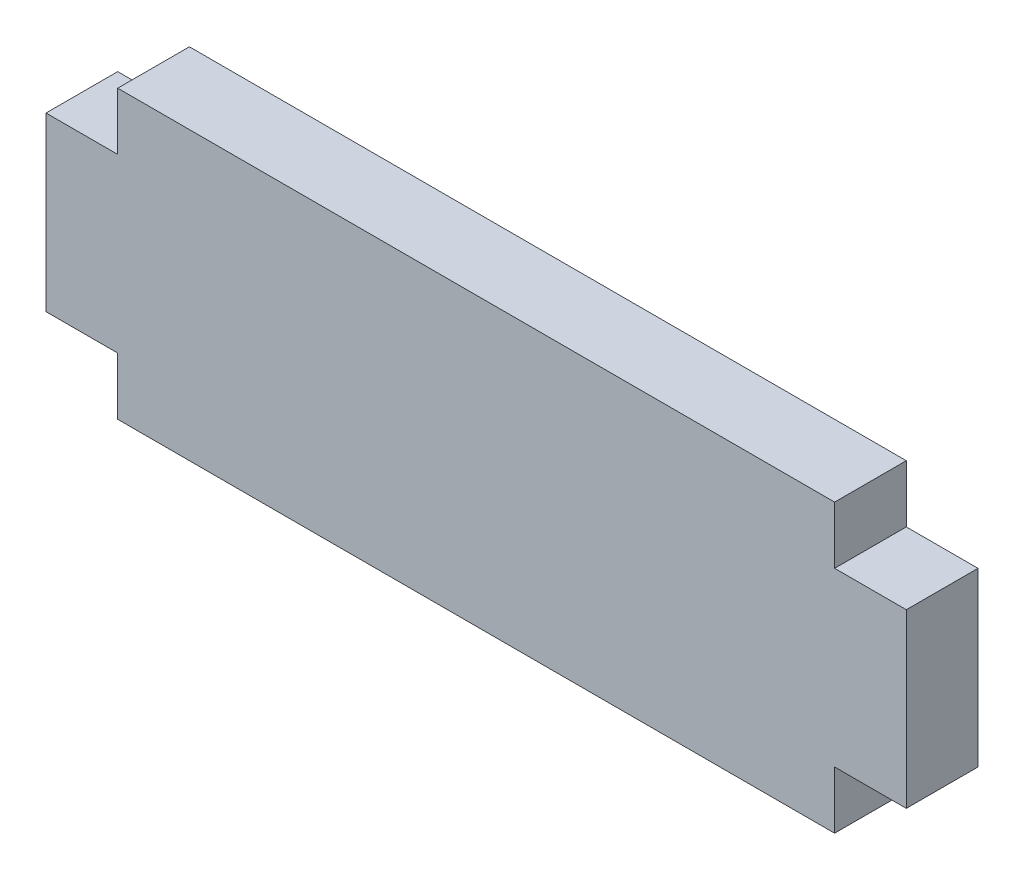
ISO-10303-21;
HEADER;
FILE_DESCRIPTION(('STEP AP214'),'2;1');
FILE_NAME('part.step','',(''),(''),'','','');
FILE_SCHEMA(('AUTOMOTIVE_DESIGN { 1 0 10303 214 1 1 1 1 }'));
ENDSEC;
DATA;
#1=APPLICATION_CONTEXT('core data for automotive mechanical design processes');
#2=APPLICATION_PROTOCOL_DEFINITION('international standard','automotive_design',2000,#1);
#3=PRODUCT_CONTEXT('',#1,'mechanical');
#4=PRODUCT('Part','Part','',(#3));
#5=PRODUCT_RELATED_PRODUCT_CATEGORY('part','',(#4));
#6=PRODUCT_DEFINITION_FORMATION('','',#4);
#7=PRODUCT_DEFINITION_CONTEXT('part definition',#1,'design');
#8=PRODUCT_DEFINITION('design','',#6,#7);
#9=PRODUCT_DEFINITION_SHAPE('','',#8);
#10=(LENGTH_UNIT() NAMED_UNIT(*) SI_UNIT(.MILLI.,.METRE.));
#11=(NAMED_UNIT(*) PLANE_ANGLE_UNIT() SI_UNIT($,.RADIAN.));
#12=(NAMED_UNIT(*) SI_UNIT($,.STERADIAN.) SOLID_ANGLE_UNIT());
#13=UNCERTAINTY_MEASURE_WITH_UNIT(LENGTH_MEASURE(1.E-05),#10,'distance_accuracy_value','');
#14=(GEOMETRIC_REPRESENTATION_CONTEXT(3) GLOBAL_UNCERTAINTY_ASSIGNED_CONTEXT((#13)) GLOBAL_UNIT_ASSIGNED_CONTEXT((#10,
#11,#12)) REPRESENTATION_CONTEXT('',''));
#15=CARTESIAN_POINT('',(0.,0.,0.));
#16=DIRECTION('',(0.,0.,1.));
#17=DIRECTION('',(1.,0.,0.));
#18=AXIS2_PLACEMENT_3D('',#15,#16,#17);
#19=CARTESIAN_POINT('',(31.75,0.,3.175));
#20=DIRECTION('',(-1.,0.,0.));
#21=DIRECTION('',(0.,0.,1.));
#22=AXIS2_PLACEMENT_3D('',#19,#20,#21);
#23=PLANE('',#22);
#24=DIRECTION('',(0.,0.,1.));
#25=VECTOR('',#24,1.);
#26=CARTESIAN_POINT('',(31.75,10.16,0.));
#27=LINE('',#26,#25);
#28=CARTESIAN_POINT('',(31.75,10.16,0.));
#29=VERTEX_POINT('',#28);
#30=CARTESIAN_POINT('',(31.75,10.16,3.175));
#31=VERTEX_POINT('',#30);
#32=EDGE_CURVE('E239',#29,#31,#27,.T.);
#33=ORIENTED_EDGE('',*,*,#32,.F.);
#34=DIRECTION('',(0.,1.,0.));
#35=VECTOR('',#34,1.);
#36=CARTESIAN_POINT('',(31.75,0.,0.));
#37=LINE('',#36,#35);
#38=CARTESIAN_POINT('',(31.75,12.7,0.));
#39=VERTEX_POINT('',#38);
#40=EDGE_CURVE('E157',#29,#39,#37,.T.);
#41=ORIENTED_EDGE('',*,*,#40,.T.);
#42=DIRECTION('',(0.,0.,-1.));
#43=VECTOR('',#42,1.);
#44=CARTESIAN_POINT('',(31.75,12.7,3.175));
#45=LINE('',#44,#43);
#46=CARTESIAN_POINT('',(31.75,12.7,3.175));
#47=VERTEX_POINT('',#46);
#48=EDGE_CURVE('E171',#47,#39,#45,.T.);
#49=ORIENTED_EDGE('',*,*,#48,.F.);
#50=DIRECTION('',(0.,1.,0.));
#51=VECTOR('',#50,1.);
#52=CARTESIAN_POINT('',(31.75,0.,3.175));
#53=LINE('',#52,#51);
#54=EDGE_CURVE('E181',#31,#47,#53,.T.);
#55=ORIENTED_EDGE('',*,*,#54,.F.);
#56=EDGE_LOOP('',(#33,#41,#49,#55));
#57=FACE_BOUND('',#56,.T.);
#58=ADVANCED_FACE('F39',(#57),#23,.F.);
#59=CARTESIAN_POINT('',(0.,0.,3.175));
#60=DIRECTION('',(1.,0.,0.));
#61=DIRECTION('',(0.,0.,-1.));
#62=AXIS2_PLACEMENT_3D('',#59,#60,#61);
#63=PLANE('',#62);
#64=DIRECTION('',(0.,0.,1.));
#65=VECTOR('',#64,1.);
#66=CARTESIAN_POINT('',(0.,2.54,0.));
#67=LINE('',#66,#65);
#68=CARTESIAN_POINT('',(0.,2.54,0.));
#69=VERTEX_POINT('',#68);
#70=CARTESIAN_POINT('',(0.,2.54,3.175));
#71=VERTEX_POINT('',#70);
#72=EDGE_CURVE('E205',#69,#71,#67,.T.);
#73=ORIENTED_EDGE('',*,*,#72,.F.);
#74=DIRECTION('',(0.,-1.,0.));
#75=VECTOR('',#74,1.);
#76=CARTESIAN_POINT('',(0.,0.,0.));
#77=LINE('',#76,#75);
#78=CARTESIAN_POINT('',(0.,0.,0.));
#79=VERTEX_POINT('',#78);
#80=EDGE_CURVE('E201',#69,#79,#77,.T.);
#81=ORIENTED_EDGE('',*,*,#80,.T.);
#82=DIRECTION('',(0.,0.,-1.));
#83=VECTOR('',#82,1.);
#84=CARTESIAN_POINT('',(0.,0.,3.175));
#85=LINE('',#84,#83);
#86=CARTESIAN_POINT('',(0.,0.,3.175));
#87=VERTEX_POINT('',#86);
#88=EDGE_CURVE('E11',#87,#79,#85,.T.);
#89=ORIENTED_EDGE('',*,*,#88,.F.);
#90=DIRECTION('',(0.,-1.,0.));
#91=VECTOR('',#90,1.);
#92=CARTESIAN_POINT('',(0.,0.,3.175));
#93=LINE('',#92,#91);
#94=EDGE_CURVE('E161',#71,#87,#93,.T.);
#95=ORIENTED_EDGE('',*,*,#94,.F.);
#96=EDGE_LOOP('',(#73,#81,#89,#95));
#97=FACE_BOUND('',#96,.T.);
#98=ADVANCED_FACE('F297',(#97),#63,.F.);
#99=CARTESIAN_POINT('',(0.,12.7,0.));
#100=VERTEX_POINT('',#99);
#101=CARTESIAN_POINT('',(0.,10.16,0.));
#102=VERTEX_POINT('',#101);
#103=EDGE_CURVE('E198',#100,#102,#77,.T.);
#104=ORIENTED_EDGE('',*,*,#103,.T.);
#105=DIRECTION('',(0.,0.,1.));
#106=VECTOR('',#105,1.);
#107=CARTESIAN_POINT('',(0.,10.16,0.));
#108=LINE('',#107,#106);
#109=CARTESIAN_POINT('',(0.,10.16,3.175));
#110=VERTEX_POINT('',#109);
#111=EDGE_CURVE('E196',#102,#110,#108,.T.);
#112=ORIENTED_EDGE('',*,*,#111,.T.);
#113=CARTESIAN_POINT('',(0.,12.7,3.175));
#114=VERTEX_POINT('',#113);
#115=EDGE_CURVE('E186',#114,#110,#93,.T.);
#116=ORIENTED_EDGE('',*,*,#115,.F.);
#117=DIRECTION('',(0.,0.,-1.));
#118=VECTOR('',#117,1.);
#119=CARTESIAN_POINT('',(0.,12.7,3.175));
#120=LINE('',#119,#118);
#121=EDGE_CURVE('E167',#114,#100,#120,.T.);
#122=ORIENTED_EDGE('',*,*,#121,.T.);
#123=EDGE_LOOP('',(#104,#112,#116,#122));
#124=FACE_BOUND('',#123,.T.);
#125=ADVANCED_FACE('F41',(#124),#63,.F.);
#126=CARTESIAN_POINT('',(0.,0.,3.175));
#127=DIRECTION('',(0.,1.,0.));
#128=DIRECTION('',(0.,0.,1.));
#129=AXIS2_PLACEMENT_3D('',#126,#127,#128);
#130=PLANE('',#129);
#131=DIRECTION('',(1.,0.,0.));
#132=VECTOR('',#131,1.);
#133=CARTESIAN_POINT('',(0.,0.,0.));
#134=LINE('',#133,#132);
#135=CARTESIAN_POINT('',(31.75,0.,0.));
#136=VERTEX_POINT('',#135);
#137=EDGE_CURVE('E163',#79,#136,#134,.T.);
#138=ORIENTED_EDGE('',*,*,#137,.T.);
#139=DIRECTION('',(0.,0.,-1.));
#140=VECTOR('',#139,1.);
#141=CARTESIAN_POINT('',(31.75,0.,3.175));
#142=LINE('',#141,#140);
#143=CARTESIAN_POINT('',(31.75,0.,3.175));
#144=VERTEX_POINT('',#143);
#145=EDGE_CURVE('E48',#144,#136,#142,.T.);
#146=ORIENTED_EDGE('',*,*,#145,.F.);
#147=DIRECTION('',(1.,0.,0.));
#148=VECTOR('',#147,1.);
#149=CARTESIAN_POINT('',(0.,0.,3.175));
#150=LINE('',#149,#148);
#151=EDGE_CURVE('E184',#87,#144,#150,.T.);
#152=ORIENTED_EDGE('',*,*,#151,.F.);
#153=ORIENTED_EDGE('',*,*,#88,.T.);
#154=EDGE_LOOP('',(#138,#146,#152,#153));
#155=FACE_BOUND('',#154,.T.);
#156=ADVANCED_FACE('F281',(#155),#130,.F.);
#157=CARTESIAN_POINT('',(31.75,2.54,0.));
#158=VERTEX_POINT('',#157);
#159=EDGE_CURVE('E145',#136,#158,#37,.T.);
#160=ORIENTED_EDGE('',*,*,#159,.T.);
#161=DIRECTION('',(0.,0.,1.));
#162=VECTOR('',#161,1.);
#163=CARTESIAN_POINT('',(31.75,2.54,0.));
#164=LINE('',#163,#162);
#165=CARTESIAN_POINT('',(31.75,2.54,3.175));
#166=VERTEX_POINT('',#165);
#167=EDGE_CURVE('E127',#158,#166,#164,.T.);
#168=ORIENTED_EDGE('',*,*,#167,.T.);
#169=EDGE_CURVE('E178',#144,#166,#53,.T.);
#170=ORIENTED_EDGE('',*,*,#169,.F.);
#171=ORIENTED_EDGE('',*,*,#145,.T.);
#172=EDGE_LOOP('',(#160,#168,#170,#171));
#173=FACE_BOUND('',#172,.T.);
#174=ADVANCED_FACE('F153',(#173),#23,.F.);
#175=CARTESIAN_POINT('',(0.,12.7,3.175));
#176=DIRECTION('',(0.,-1.,0.));
#177=DIRECTION('',(0.,0.,-1.));
#178=AXIS2_PLACEMENT_3D('',#175,#176,#177);
#179=PLANE('',#178);
#180=DIRECTION('',(-1.,0.,0.));
#181=VECTOR('',#180,1.);
#182=CARTESIAN_POINT('',(0.,12.7,0.));
#183=LINE('',#182,#181);
#184=EDGE_CURVE('E156',#39,#100,#183,.T.);
#185=ORIENTED_EDGE('',*,*,#184,.T.);
#186=ORIENTED_EDGE('',*,*,#121,.F.);
#187=DIRECTION('',(-1.,0.,0.));
#188=VECTOR('',#187,1.);
#189=CARTESIAN_POINT('',(0.,12.7,3.175));
#190=LINE('',#189,#188);
#191=EDGE_CURVE('E172',#47,#114,#190,.T.);
#192=ORIENTED_EDGE('',*,*,#191,.F.);
#193=ORIENTED_EDGE('',*,*,#48,.T.);
#194=EDGE_LOOP('',(#185,#186,#192,#193));
#195=FACE_BOUND('',#194,.T.);
#196=ADVANCED_FACE('F286',(#195),#179,.F.);
#197=CARTESIAN_POINT('',(0.,0.,3.175));
#198=DIRECTION('',(0.,0.,-1.));
#199=DIRECTION('',(-1.,0.,0.));
#200=AXIS2_PLACEMENT_3D('',#197,#198,#199);
#201=PLANE('',#200);
#202=ORIENTED_EDGE('',*,*,#115,.T.);
#203=DIRECTION('',(-1.,0.,0.));
#204=VECTOR('',#203,1.);
#205=CARTESIAN_POINT('',(0.,10.16,3.175));
#206=LINE('',#205,#204);
#207=CARTESIAN_POINT('',(-3.175,10.16,3.175));
#208=VERTEX_POINT('',#207);
#209=EDGE_CURVE('E63',#110,#208,#206,.T.);
#210=ORIENTED_EDGE('',*,*,#209,.T.);
#211=DIRECTION('',(0.,-1.,0.));
#212=VECTOR('',#211,1.);
#213=CARTESIAN_POINT('',(-3.175,10.16,3.175));
#214=LINE('',#213,#212);
#215=CARTESIAN_POINT('',(-3.175,2.54,3.175));
#216=VERTEX_POINT('',#215);
#217=EDGE_CURVE('E238',#208,#216,#214,.T.);
#218=ORIENTED_EDGE('',*,*,#217,.T.);
#219=DIRECTION('',(1.,0.,0.));
#220=VECTOR('',#219,1.);
#221=CARTESIAN_POINT('',(0.,2.54,3.175));
#222=LINE('',#221,#220);
#223=EDGE_CURVE('E219',#216,#71,#222,.T.);
#224=ORIENTED_EDGE('',*,*,#223,.T.);
#225=ORIENTED_EDGE('',*,*,#94,.T.);
#226=ORIENTED_EDGE('',*,*,#151,.T.);
#227=ORIENTED_EDGE('',*,*,#169,.T.);
#228=DIRECTION('',(1.,0.,0.));
#229=VECTOR('',#228,1.);
#230=CARTESIAN_POINT('',(31.75,2.54,3.175));
#231=LINE('',#230,#229);
#232=CARTESIAN_POINT('',(34.925,2.54,3.175));
#233=VERTEX_POINT('',#232);
#234=EDGE_CURVE('E55',#166,#233,#231,.T.);
#235=ORIENTED_EDGE('',*,*,#234,.T.);
#236=DIRECTION('',(0.,1.,0.));
#237=VECTOR('',#236,1.);
#238=CARTESIAN_POINT('',(34.925,10.16,3.175));
#239=LINE('',#238,#237);
#240=CARTESIAN_POINT('',(34.925,10.16,3.175));
#241=VERTEX_POINT('',#240);
#242=EDGE_CURVE('E256',#233,#241,#239,.T.);
#243=ORIENTED_EDGE('',*,*,#242,.T.);
#244=DIRECTION('',(-1.,0.,0.));
#245=VECTOR('',#244,1.);
#246=CARTESIAN_POINT('',(31.75,10.16,3.175));
#247=LINE('',#246,#245);
#248=EDGE_CURVE('E150',#241,#31,#247,.T.);
#249=ORIENTED_EDGE('',*,*,#248,.T.);
#250=ORIENTED_EDGE('',*,*,#54,.T.);
#251=ORIENTED_EDGE('',*,*,#191,.T.);
#252=EDGE_LOOP('',(#202,#210,#218,#224,#225,#226,#227,#235,#243,#249,#250,#251));
#253=FACE_BOUND('',#252,.T.);
#254=ADVANCED_FACE('F278',(#253),#201,.F.);
#255=CARTESIAN_POINT('',(0.,0.,0.));
#256=DIRECTION('',(0.,0.,-1.));
#257=DIRECTION('',(-1.,0.,0.));
#258=AXIS2_PLACEMENT_3D('',#255,#256,#257);
#259=PLANE('',#258);
#260=ORIENTED_EDGE('',*,*,#103,.F.);
#261=ORIENTED_EDGE('',*,*,#184,.F.);
#262=ORIENTED_EDGE('',*,*,#40,.F.);
#263=DIRECTION('',(-1.,0.,0.));
#264=VECTOR('',#263,1.);
#265=CARTESIAN_POINT('',(31.75,10.16,0.));
#266=LINE('',#265,#264);
#267=CARTESIAN_POINT('',(34.925,10.16,0.));
#268=VERTEX_POINT('',#267);
#269=EDGE_CURVE('E137',#268,#29,#266,.T.);
#270=ORIENTED_EDGE('',*,*,#269,.F.);
#271=DIRECTION('',(0.,1.,0.));
#272=VECTOR('',#271,1.);
#273=CARTESIAN_POINT('',(34.925,10.16,0.));
#274=LINE('',#273,#272);
#275=CARTESIAN_POINT('',(34.925,2.54,0.));
#276=VERTEX_POINT('',#275);
#277=EDGE_CURVE('E148',#276,#268,#274,.T.);
#278=ORIENTED_EDGE('',*,*,#277,.F.);
#279=DIRECTION('',(1.,0.,0.));
#280=VECTOR('',#279,1.);
#281=CARTESIAN_POINT('',(31.75,2.54,0.));
#282=LINE('',#281,#280);
#283=EDGE_CURVE('E130',#158,#276,#282,.T.);
#284=ORIENTED_EDGE('',*,*,#283,.F.);
#285=ORIENTED_EDGE('',*,*,#159,.F.);
#286=ORIENTED_EDGE('',*,*,#137,.F.);
#287=ORIENTED_EDGE('',*,*,#80,.F.);
#288=DIRECTION('',(1.,0.,0.));
#289=VECTOR('',#288,1.);
#290=CARTESIAN_POINT('',(0.,2.54,0.));
#291=LINE('',#290,#289);
#292=CARTESIAN_POINT('',(-3.175,2.54,0.));
#293=VERTEX_POINT('',#292);
#294=EDGE_CURVE('E225',#293,#69,#291,.T.);
#295=ORIENTED_EDGE('',*,*,#294,.F.);
#296=DIRECTION('',(0.,-1.,0.));
#297=VECTOR('',#296,1.);
#298=CARTESIAN_POINT('',(-3.175,10.16,0.));
#299=LINE('',#298,#297);
#300=CARTESIAN_POINT('',(-3.175,10.16,0.));
#301=VERTEX_POINT('',#300);
#302=EDGE_CURVE('E228',#301,#293,#299,.T.);
#303=ORIENTED_EDGE('',*,*,#302,.F.);
#304=DIRECTION('',(-1.,0.,0.));
#305=VECTOR('',#304,1.);
#306=CARTESIAN_POINT('',(0.,10.16,0.));
#307=LINE('',#306,#305);
#308=EDGE_CURVE('E233',#102,#301,#307,.T.);
#309=ORIENTED_EDGE('',*,*,#308,.F.);
#310=EDGE_LOOP('',(#260,#261,#262,#270,#278,#284,#285,#286,#287,#295,#303,#309));
#311=FACE_BOUND('',#310,.T.);
#312=ADVANCED_FACE('F143',(#311),#259,.T.);
#313=CARTESIAN_POINT('',(0.,2.54,0.));
#314=DIRECTION('',(0.,-1.,0.));
#315=DIRECTION('',(0.,0.,-1.));
#316=AXIS2_PLACEMENT_3D('',#313,#314,#315);
#317=PLANE('',#316);
#318=ORIENTED_EDGE('',*,*,#223,.F.);
#319=DIRECTION('',(0.,0.,1.));
#320=VECTOR('',#319,1.);
#321=CARTESIAN_POINT('',(-3.175,2.54,0.));
#322=LINE('',#321,#320);
#323=EDGE_CURVE('E211',#293,#216,#322,.T.);
#324=ORIENTED_EDGE('',*,*,#323,.F.);
#325=ORIENTED_EDGE('',*,*,#294,.T.);
#326=ORIENTED_EDGE('',*,*,#72,.T.);
#327=EDGE_LOOP('',(#318,#324,#325,#326));
#328=FACE_BOUND('',#327,.T.);
#329=ADVANCED_FACE('F350',(#328),#317,.T.);
#330=CARTESIAN_POINT('',(-3.175,10.16,0.));
#331=DIRECTION('',(-1.,0.,0.));
#332=DIRECTION('',(0.,0.,1.));
#333=AXIS2_PLACEMENT_3D('',#330,#331,#332);
#334=PLANE('',#333);
#335=ORIENTED_EDGE('',*,*,#217,.F.);
#336=DIRECTION('',(0.,0.,1.));
#337=VECTOR('',#336,1.);
#338=CARTESIAN_POINT('',(-3.175,10.16,0.));
#339=LINE('',#338,#337);
#340=EDGE_CURVE('E216',#301,#208,#339,.T.);
#341=ORIENTED_EDGE('',*,*,#340,.F.);
#342=ORIENTED_EDGE('',*,*,#302,.T.);
#343=ORIENTED_EDGE('',*,*,#323,.T.);
#344=EDGE_LOOP('',(#335,#341,#342,#343));
#345=FACE_BOUND('',#344,.T.);
#346=ADVANCED_FACE('F284',(#345),#334,.T.);
#347=CARTESIAN_POINT('',(0.,10.16,0.));
#348=DIRECTION('',(0.,1.,0.));
#349=DIRECTION('',(0.,0.,1.));
#350=AXIS2_PLACEMENT_3D('',#347,#348,#349);
#351=PLANE('',#350);
#352=ORIENTED_EDGE('',*,*,#209,.F.);
#353=ORIENTED_EDGE('',*,*,#111,.F.);
#354=ORIENTED_EDGE('',*,*,#308,.T.);
#355=ORIENTED_EDGE('',*,*,#340,.T.);
#356=EDGE_LOOP('',(#352,#353,#354,#355));
#357=FACE_BOUND('',#356,.T.);
#358=ADVANCED_FACE('F366',(#357),#351,.T.);
#359=CARTESIAN_POINT('',(31.75,10.16,0.));
#360=DIRECTION('',(0.,1.,0.));
#361=DIRECTION('',(-1.,0.,0.));
#362=AXIS2_PLACEMENT_3D('',#359,#360,#361);
#363=PLANE('',#362);
#364=ORIENTED_EDGE('',*,*,#248,.F.);
#365=DIRECTION('',(0.,0.,1.));
#366=VECTOR('',#365,1.);
#367=CARTESIAN_POINT('',(34.925,10.16,0.));
#368=LINE('',#367,#366);
#369=EDGE_CURVE('E248',#268,#241,#368,.T.);
#370=ORIENTED_EDGE('',*,*,#369,.F.);
#371=ORIENTED_EDGE('',*,*,#269,.T.);
#372=ORIENTED_EDGE('',*,*,#32,.T.);
#373=EDGE_LOOP('',(#364,#370,#371,#372));
#374=FACE_BOUND('',#373,.T.);
#375=ADVANCED_FACE('F273',(#374),#363,.T.);
#376=CARTESIAN_POINT('',(34.925,10.16,0.));
#377=DIRECTION('',(1.,0.,0.));
#378=DIRECTION('',(0.,0.,-1.));
#379=AXIS2_PLACEMENT_3D('',#376,#377,#378);
#380=PLANE('',#379);
#381=ORIENTED_EDGE('',*,*,#242,.F.);
#382=DIRECTION('',(0.,0.,1.));
#383=VECTOR('',#382,1.);
#384=CARTESIAN_POINT('',(34.925,2.54,0.));
#385=LINE('',#384,#383);
#386=EDGE_CURVE('E136',#276,#233,#385,.T.);
#387=ORIENTED_EDGE('',*,*,#386,.F.);
#388=ORIENTED_EDGE('',*,*,#277,.T.);
#389=ORIENTED_EDGE('',*,*,#369,.T.);
#390=EDGE_LOOP('',(#381,#387,#388,#389));
#391=FACE_BOUND('',#390,.T.);
#392=ADVANCED_FACE('F267',(#391),#380,.T.);
#393=CARTESIAN_POINT('',(31.75,2.54,0.));
#394=DIRECTION('',(0.,-1.,0.));
#395=DIRECTION('',(1.,0.,0.));
#396=AXIS2_PLACEMENT_3D('',#393,#394,#395);
#397=PLANE('',#396);
#398=ORIENTED_EDGE('',*,*,#234,.F.);
#399=ORIENTED_EDGE('',*,*,#167,.F.);
#400=ORIENTED_EDGE('',*,*,#283,.T.);
#401=ORIENTED_EDGE('',*,*,#386,.T.);
#402=EDGE_LOOP('',(#398,#399,#400,#401));
#403=FACE_BOUND('',#402,.T.);
#404=ADVANCED_FACE('F129',(#403),#397,.T.);
#405=CLOSED_SHELL('',(#58,#98,#125,#156,#174,#196,#254,#312,#329,#346,#358,#375,#392,#404));
#406=MANIFOLD_SOLID_BREP('B2',#405);
#407=ADVANCED_BREP_SHAPE_REPRESENTATION('',(#18,#406),#14);
#408=SHAPE_DEFINITION_REPRESENTATION(#9,#407);
ENDSEC;
END-ISO-10303-21;
